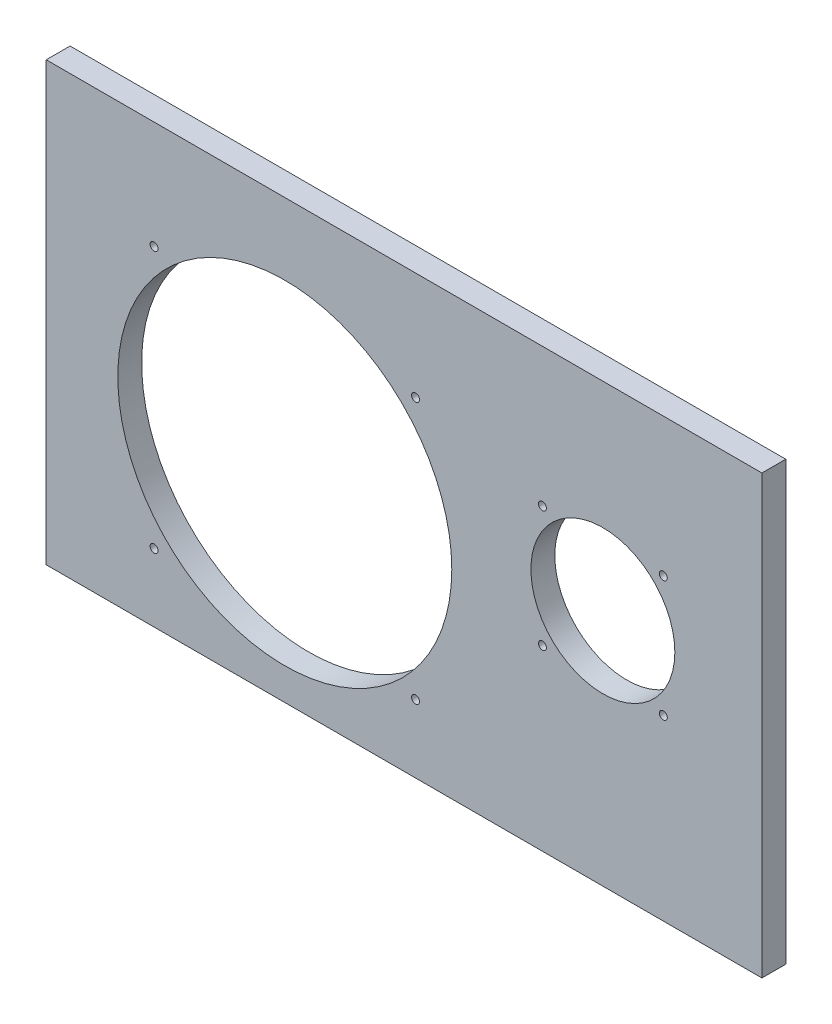
ISO-10303-21;
HEADER;
FILE_DESCRIPTION(('STEP AP214'),'2;1');
FILE_NAME('part.step','',(''),(''),'','','');
FILE_SCHEMA(('AUTOMOTIVE_DESIGN { 1 0 10303 214 1 1 1 1 }'));
ENDSEC;
DATA;
#1=APPLICATION_CONTEXT('core data for automotive mechanical design processes');
#2=APPLICATION_PROTOCOL_DEFINITION('international standard','automotive_design',2000,#1);
#3=PRODUCT_CONTEXT('',#1,'mechanical');
#4=PRODUCT('Part','Part','',(#3));
#5=PRODUCT_RELATED_PRODUCT_CATEGORY('part','',(#4));
#6=PRODUCT_DEFINITION_FORMATION('','',#4);
#7=PRODUCT_DEFINITION_CONTEXT('part definition',#1,'design');
#8=PRODUCT_DEFINITION('design','',#6,#7);
#9=PRODUCT_DEFINITION_SHAPE('','',#8);
#10=(LENGTH_UNIT() NAMED_UNIT(*) SI_UNIT(.MILLI.,.METRE.));
#11=(NAMED_UNIT(*) PLANE_ANGLE_UNIT() SI_UNIT($,.RADIAN.));
#12=(NAMED_UNIT(*) SI_UNIT($,.STERADIAN.) SOLID_ANGLE_UNIT());
#13=UNCERTAINTY_MEASURE_WITH_UNIT(LENGTH_MEASURE(1.E-05),#10,'distance_accuracy_value','');
#14=(GEOMETRIC_REPRESENTATION_CONTEXT(3) GLOBAL_UNCERTAINTY_ASSIGNED_CONTEXT((#13)) GLOBAL_UNIT_ASSIGNED_CONTEXT((#10,
#11,#12)) REPRESENTATION_CONTEXT('',''));
#15=CARTESIAN_POINT('',(0.,0.,0.));
#16=DIRECTION('',(0.,0.,1.));
#17=DIRECTION('',(1.,0.,0.));
#18=AXIS2_PLACEMENT_3D('',#15,#16,#17);
#19=CARTESIAN_POINT('',(0.,0.,6.));
#20=DIRECTION('',(0.,0.,-1.));
#21=DIRECTION('',(-1.,0.,0.));
#22=AXIS2_PLACEMENT_3D('',#19,#20,#21);
#23=PLANE('',#22);
#24=CARTESIAN_POINT('',(155.202795795511,44.7972042044892,6.));
#25=DIRECTION('',(0.,0.,-1.));
#26=DIRECTION('',(-1.,0.,0.));
#27=AXIS2_PLACEMENT_3D('',#24,#25,#26);
#28=CIRCLE('',#27,0.999999999999998);
#29=CARTESIAN_POINT('',(154.202795795511,44.7972042044892,6.));
#30=VERTEX_POINT('',#29);
#31=EDGE_CURVE('E165',#30,#30,#28,.F.);
#32=ORIENTED_EDGE('',*,*,#31,.F.);
#33=EDGE_LOOP('',(#32));
#34=FACE_BOUND('',#33,.T.);
#35=CARTESIAN_POINT('',(155.202795795511,75.2027957955108,6.));
#36=DIRECTION('',(0.,0.,-1.));
#37=DIRECTION('',(-1.,0.,0.));
#38=AXIS2_PLACEMENT_3D('',#35,#36,#37);
#39=CIRCLE('',#38,0.999999999999998);
#40=CARTESIAN_POINT('',(154.202795795511,75.2027957955108,6.));
#41=VERTEX_POINT('',#40);
#42=EDGE_CURVE('E159',#41,#41,#39,.F.);
#43=ORIENTED_EDGE('',*,*,#42,.F.);
#44=EDGE_LOOP('',(#43));
#45=FACE_BOUND('',#44,.T.);
#46=CARTESIAN_POINT('',(124.797204204489,75.2027957955107,6.));
#47=DIRECTION('',(0.,0.,-1.));
#48=DIRECTION('',(-1.,0.,0.));
#49=AXIS2_PLACEMENT_3D('',#46,#47,#48);
#50=CIRCLE('',#49,0.999999999999985);
#51=CARTESIAN_POINT('',(123.797204204489,75.2027957955107,6.));
#52=VERTEX_POINT('',#51);
#53=EDGE_CURVE('E153',#52,#52,#50,.F.);
#54=ORIENTED_EDGE('',*,*,#53,.F.);
#55=EDGE_LOOP('',(#54));
#56=FACE_BOUND('',#55,.T.);
#57=CARTESIAN_POINT('',(124.797204204489,44.7972042044892,6.));
#58=DIRECTION('',(0.,0.,-1.));
#59=DIRECTION('',(-1.,0.,0.));
#60=AXIS2_PLACEMENT_3D('',#57,#58,#59);
#61=CIRCLE('',#60,0.999999999999983);
#62=CARTESIAN_POINT('',(123.797204204489,44.7972042044892,6.));
#63=VERTEX_POINT('',#62);
#64=EDGE_CURVE('E147',#63,#63,#61,.F.);
#65=ORIENTED_EDGE('',*,*,#64,.F.);
#66=EDGE_LOOP('',(#65));
#67=FACE_BOUND('',#66,.T.);
#68=CARTESIAN_POINT('',(92.8804653251745,17.1195346748255,6.));
#69=DIRECTION('',(0.,0.,-1.));
#70=DIRECTION('',(-1.,0.,0.));
#71=AXIS2_PLACEMENT_3D('',#68,#69,#70);
#72=CIRCLE('',#71,0.999999999999998);
#73=CARTESIAN_POINT('',(91.8804653251745,17.1195346748255,6.));
#74=VERTEX_POINT('',#73);
#75=EDGE_CURVE('E141',#74,#74,#72,.F.);
#76=ORIENTED_EDGE('',*,*,#75,.F.);
#77=EDGE_LOOP('',(#76));
#78=FACE_BOUND('',#77,.T.);
#79=CARTESIAN_POINT('',(27.1195346748255,17.1195346748255,6.));
#80=DIRECTION('',(0.,0.,-1.));
#81=DIRECTION('',(-1.,0.,0.));
#82=AXIS2_PLACEMENT_3D('',#79,#80,#81);
#83=CIRCLE('',#82,1.);
#84=CARTESIAN_POINT('',(26.1195346748255,17.1195346748255,6.));
#85=VERTEX_POINT('',#84);
#86=EDGE_CURVE('E135',#85,#85,#83,.F.);
#87=ORIENTED_EDGE('',*,*,#86,.F.);
#88=EDGE_LOOP('',(#87));
#89=FACE_BOUND('',#88,.T.);
#90=CARTESIAN_POINT('',(92.8804653251745,82.8804653251745,6.));
#91=DIRECTION('',(0.,0.,-1.));
#92=DIRECTION('',(-1.,0.,0.));
#93=AXIS2_PLACEMENT_3D('',#90,#91,#92);
#94=CIRCLE('',#93,0.999999999999998);
#95=CARTESIAN_POINT('',(91.8804653251745,82.8804653251745,6.));
#96=VERTEX_POINT('',#95);
#97=EDGE_CURVE('E129',#96,#96,#94,.F.);
#98=ORIENTED_EDGE('',*,*,#97,.F.);
#99=EDGE_LOOP('',(#98));
#100=FACE_BOUND('',#99,.T.);
#101=CARTESIAN_POINT('',(27.1195346748255,82.8804653251745,6.));
#102=DIRECTION('',(0.,0.,-1.));
#103=DIRECTION('',(-1.,0.,0.));
#104=AXIS2_PLACEMENT_3D('',#101,#102,#103);
#105=CIRCLE('',#104,1.00000000000002);
#106=CARTESIAN_POINT('',(26.1195346748255,82.8804653251745,6.));
#107=VERTEX_POINT('',#106);
#108=EDGE_CURVE('E121',#107,#107,#105,.F.);
#109=ORIENTED_EDGE('',*,*,#108,.F.);
#110=EDGE_LOOP('',(#109));
#111=FACE_BOUND('',#110,.T.);
#112=DIRECTION('',(0.,-1.,0.));
#113=VECTOR('',#112,1.);
#114=CARTESIAN_POINT('',(0.,0.,6.));
#115=LINE('',#114,#113);
#116=CARTESIAN_POINT('',(0.,110.,6.));
#117=VERTEX_POINT('',#116);
#118=CARTESIAN_POINT('',(0.,0.,6.));
#119=VERTEX_POINT('',#118);
#120=EDGE_CURVE('E85',#117,#119,#115,.T.);
#121=ORIENTED_EDGE('',*,*,#120,.T.);
#122=DIRECTION('',(1.,0.,0.));
#123=VECTOR('',#122,1.);
#124=CARTESIAN_POINT('',(0.,0.,6.));
#125=LINE('',#124,#123);
#126=CARTESIAN_POINT('',(180.,0.,6.));
#127=VERTEX_POINT('',#126);
#128=EDGE_CURVE('E80',#119,#127,#125,.T.);
#129=ORIENTED_EDGE('',*,*,#128,.T.);
#130=DIRECTION('',(0.,1.,0.));
#131=VECTOR('',#130,1.);
#132=CARTESIAN_POINT('',(180.,0.,6.));
#133=LINE('',#132,#131);
#134=CARTESIAN_POINT('',(180.,110.,6.));
#135=VERTEX_POINT('',#134);
#136=EDGE_CURVE('E83',#127,#135,#133,.T.);
#137=ORIENTED_EDGE('',*,*,#136,.T.);
#138=DIRECTION('',(-1.,0.,0.));
#139=VECTOR('',#138,1.);
#140=CARTESIAN_POINT('',(0.,110.,6.));
#141=LINE('',#140,#139);
#142=EDGE_CURVE('E50',#135,#117,#141,.T.);
#143=ORIENTED_EDGE('',*,*,#142,.T.);
#144=EDGE_LOOP('',(#121,#129,#137,#143));
#145=FACE_BOUND('',#144,.T.);
#146=CARTESIAN_POINT('',(60.,50.,6.));
#147=DIRECTION('',(0.,0.,1.));
#148=DIRECTION('',(1.,0.,0.));
#149=AXIS2_PLACEMENT_3D('',#146,#147,#148);
#150=CIRCLE('',#149,42.);
#151=CARTESIAN_POINT('',(102.,50.,6.));
#152=VERTEX_POINT('',#151);
#153=EDGE_CURVE('E100',#152,#152,#150,.T.);
#154=ORIENTED_EDGE('',*,*,#153,.F.);
#155=EDGE_LOOP('',(#154));
#156=FACE_BOUND('',#155,.T.);
#157=CARTESIAN_POINT('',(140.,60.,6.));
#158=DIRECTION('',(0.,0.,1.));
#159=DIRECTION('',(1.,0.,0.));
#160=AXIS2_PLACEMENT_3D('',#157,#158,#159);
#161=CIRCLE('',#160,18.1);
#162=CARTESIAN_POINT('',(158.1,60.,6.));
#163=VERTEX_POINT('',#162);
#164=EDGE_CURVE('E115',#163,#163,#161,.T.);
#165=ORIENTED_EDGE('',*,*,#164,.F.);
#166=EDGE_LOOP('',(#165));
#167=FACE_BOUND('',#166,.T.);
#168=ADVANCED_FACE('F33',(#34,#45,#56,#67,#78,#89,#100,#111,#145,#156,#167),#23,.F.);
#169=CARTESIAN_POINT('',(0.,0.,0.));
#170=DIRECTION('',(0.,0.,-1.));
#171=DIRECTION('',(-1.,0.,0.));
#172=AXIS2_PLACEMENT_3D('',#169,#170,#171);
#173=PLANE('',#172);
#174=CARTESIAN_POINT('',(155.202795795511,44.7972042044892,0.));
#175=DIRECTION('',(0.,0.,1.));
#176=DIRECTION('',(1.,0.,0.));
#177=AXIS2_PLACEMENT_3D('',#174,#175,#176);
#178=CIRCLE('',#177,0.999999999999998);
#179=CARTESIAN_POINT('',(156.202795795511,44.7972042044892,0.));
#180=VERTEX_POINT('',#179);
#181=EDGE_CURVE('E168',#180,#180,#178,.T.);
#182=ORIENTED_EDGE('',*,*,#181,.T.);
#183=EDGE_LOOP('',(#182));
#184=FACE_BOUND('',#183,.T.);
#185=CARTESIAN_POINT('',(155.202795795511,75.2027957955108,0.));
#186=DIRECTION('',(0.,0.,1.));
#187=DIRECTION('',(1.,0.,0.));
#188=AXIS2_PLACEMENT_3D('',#185,#186,#187);
#189=CIRCLE('',#188,0.999999999999998);
#190=CARTESIAN_POINT('',(156.202795795511,75.2027957955108,0.));
#191=VERTEX_POINT('',#190);
#192=EDGE_CURVE('E162',#191,#191,#189,.T.);
#193=ORIENTED_EDGE('',*,*,#192,.T.);
#194=EDGE_LOOP('',(#193));
#195=FACE_BOUND('',#194,.T.);
#196=CARTESIAN_POINT('',(124.797204204489,75.2027957955107,0.));
#197=DIRECTION('',(0.,0.,1.));
#198=DIRECTION('',(1.,0.,0.));
#199=AXIS2_PLACEMENT_3D('',#196,#197,#198);
#200=CIRCLE('',#199,0.999999999999985);
#201=CARTESIAN_POINT('',(125.797204204489,75.2027957955107,0.));
#202=VERTEX_POINT('',#201);
#203=EDGE_CURVE('E156',#202,#202,#200,.T.);
#204=ORIENTED_EDGE('',*,*,#203,.T.);
#205=EDGE_LOOP('',(#204));
#206=FACE_BOUND('',#205,.T.);
#207=CARTESIAN_POINT('',(124.797204204489,44.7972042044892,0.));
#208=DIRECTION('',(0.,0.,1.));
#209=DIRECTION('',(1.,0.,0.));
#210=AXIS2_PLACEMENT_3D('',#207,#208,#209);
#211=CIRCLE('',#210,0.999999999999983);
#212=CARTESIAN_POINT('',(125.797204204489,44.7972042044892,0.));
#213=VERTEX_POINT('',#212);
#214=EDGE_CURVE('E150',#213,#213,#211,.T.);
#215=ORIENTED_EDGE('',*,*,#214,.T.);
#216=EDGE_LOOP('',(#215));
#217=FACE_BOUND('',#216,.T.);
#218=CARTESIAN_POINT('',(92.8804653251745,17.1195346748255,0.));
#219=DIRECTION('',(0.,0.,1.));
#220=DIRECTION('',(1.,0.,0.));
#221=AXIS2_PLACEMENT_3D('',#218,#219,#220);
#222=CIRCLE('',#221,0.999999999999998);
#223=CARTESIAN_POINT('',(93.8804653251745,17.1195346748255,0.));
#224=VERTEX_POINT('',#223);
#225=EDGE_CURVE('E144',#224,#224,#222,.T.);
#226=ORIENTED_EDGE('',*,*,#225,.T.);
#227=EDGE_LOOP('',(#226));
#228=FACE_BOUND('',#227,.T.);
#229=CARTESIAN_POINT('',(27.1195346748255,17.1195346748255,0.));
#230=DIRECTION('',(0.,0.,1.));
#231=DIRECTION('',(1.,0.,0.));
#232=AXIS2_PLACEMENT_3D('',#229,#230,#231);
#233=CIRCLE('',#232,1.);
#234=CARTESIAN_POINT('',(28.1195346748255,17.1195346748255,0.));
#235=VERTEX_POINT('',#234);
#236=EDGE_CURVE('E138',#235,#235,#233,.T.);
#237=ORIENTED_EDGE('',*,*,#236,.T.);
#238=EDGE_LOOP('',(#237));
#239=FACE_BOUND('',#238,.T.);
#240=CARTESIAN_POINT('',(92.8804653251745,82.8804653251745,0.));
#241=DIRECTION('',(0.,0.,1.));
#242=DIRECTION('',(1.,0.,0.));
#243=AXIS2_PLACEMENT_3D('',#240,#241,#242);
#244=CIRCLE('',#243,0.999999999999998);
#245=CARTESIAN_POINT('',(93.8804653251745,82.8804653251745,0.));
#246=VERTEX_POINT('',#245);
#247=EDGE_CURVE('E132',#246,#246,#244,.T.);
#248=ORIENTED_EDGE('',*,*,#247,.T.);
#249=EDGE_LOOP('',(#248));
#250=FACE_BOUND('',#249,.T.);
#251=CARTESIAN_POINT('',(27.1195346748255,82.8804653251745,0.));
#252=DIRECTION('',(0.,0.,1.));
#253=DIRECTION('',(1.,0.,0.));
#254=AXIS2_PLACEMENT_3D('',#251,#252,#253);
#255=CIRCLE('',#254,1.00000000000002);
#256=CARTESIAN_POINT('',(28.1195346748255,82.8804653251745,0.));
#257=VERTEX_POINT('',#256);
#258=EDGE_CURVE('E126',#257,#257,#255,.T.);
#259=ORIENTED_EDGE('',*,*,#258,.T.);
#260=EDGE_LOOP('',(#259));
#261=FACE_BOUND('',#260,.T.);
#262=CARTESIAN_POINT('',(60.,50.,0.));
#263=DIRECTION('',(0.,0.,1.));
#264=DIRECTION('',(1.,0.,0.));
#265=AXIS2_PLACEMENT_3D('',#262,#263,#264);
#266=CIRCLE('',#265,42.);
#267=CARTESIAN_POINT('',(102.,50.,0.));
#268=VERTEX_POINT('',#267);
#269=EDGE_CURVE('E112',#268,#268,#266,.T.);
#270=ORIENTED_EDGE('',*,*,#269,.T.);
#271=EDGE_LOOP('',(#270));
#272=FACE_BOUND('',#271,.T.);
#273=DIRECTION('',(0.,-1.,0.));
#274=VECTOR('',#273,1.);
#275=CARTESIAN_POINT('',(0.,0.,0.));
#276=LINE('',#275,#274);
#277=CARTESIAN_POINT('',(0.,110.,0.));
#278=VERTEX_POINT('',#277);
#279=CARTESIAN_POINT('',(0.,0.,0.));
#280=VERTEX_POINT('',#279);
#281=EDGE_CURVE('E97',#278,#280,#276,.T.);
#282=ORIENTED_EDGE('',*,*,#281,.F.);
#283=DIRECTION('',(-1.,0.,0.));
#284=VECTOR('',#283,1.);
#285=CARTESIAN_POINT('',(0.,110.,0.));
#286=LINE('',#285,#284);
#287=CARTESIAN_POINT('',(180.,110.,0.));
#288=VERTEX_POINT('',#287);
#289=EDGE_CURVE('E73',#288,#278,#286,.T.);
#290=ORIENTED_EDGE('',*,*,#289,.F.);
#291=DIRECTION('',(0.,1.,0.));
#292=VECTOR('',#291,1.);
#293=CARTESIAN_POINT('',(180.,0.,0.));
#294=LINE('',#293,#292);
#295=CARTESIAN_POINT('',(180.,0.,0.));
#296=VERTEX_POINT('',#295);
#297=EDGE_CURVE('E67',#296,#288,#294,.T.);
#298=ORIENTED_EDGE('',*,*,#297,.F.);
#299=DIRECTION('',(1.,0.,0.));
#300=VECTOR('',#299,1.);
#301=CARTESIAN_POINT('',(0.,0.,0.));
#302=LINE('',#301,#300);
#303=EDGE_CURVE('E89',#280,#296,#302,.T.);
#304=ORIENTED_EDGE('',*,*,#303,.F.);
#305=EDGE_LOOP('',(#282,#290,#298,#304));
#306=FACE_BOUND('',#305,.T.);
#307=CARTESIAN_POINT('',(140.,60.,0.));
#308=DIRECTION('',(0.,0.,1.));
#309=DIRECTION('',(1.,0.,0.));
#310=AXIS2_PLACEMENT_3D('',#307,#308,#309);
#311=CIRCLE('',#310,18.1);
#312=CARTESIAN_POINT('',(158.1,60.,0.));
#313=VERTEX_POINT('',#312);
#314=EDGE_CURVE('E118',#313,#313,#311,.T.);
#315=ORIENTED_EDGE('',*,*,#314,.T.);
#316=EDGE_LOOP('',(#315));
#317=FACE_BOUND('',#316,.T.);
#318=ADVANCED_FACE('F108',(#184,#195,#206,#217,#228,#239,#250,#261,#272,#306,#317),#173,.T.);
#319=CARTESIAN_POINT('',(0.,0.,6.));
#320=DIRECTION('',(1.,0.,0.));
#321=DIRECTION('',(0.,0.,-1.));
#322=AXIS2_PLACEMENT_3D('',#319,#320,#321);
#323=PLANE('',#322);
#324=ORIENTED_EDGE('',*,*,#281,.T.);
#325=DIRECTION('',(0.,0.,-1.));
#326=VECTOR('',#325,1.);
#327=CARTESIAN_POINT('',(0.,0.,6.));
#328=LINE('',#327,#326);
#329=EDGE_CURVE('E11',#119,#280,#328,.T.);
#330=ORIENTED_EDGE('',*,*,#329,.F.);
#331=ORIENTED_EDGE('',*,*,#120,.F.);
#332=DIRECTION('',(0.,0.,-1.));
#333=VECTOR('',#332,1.);
#334=CARTESIAN_POINT('',(0.,110.,6.));
#335=LINE('',#334,#333);
#336=EDGE_CURVE('E93',#117,#278,#335,.T.);
#337=ORIENTED_EDGE('',*,*,#336,.T.);
#338=EDGE_LOOP('',(#324,#330,#331,#337));
#339=FACE_BOUND('',#338,.T.);
#340=ADVANCED_FACE('F35',(#339),#323,.F.);
#341=CARTESIAN_POINT('',(0.,0.,6.));
#342=DIRECTION('',(0.,1.,0.));
#343=DIRECTION('',(0.,0.,1.));
#344=AXIS2_PLACEMENT_3D('',#341,#342,#343);
#345=PLANE('',#344);
#346=ORIENTED_EDGE('',*,*,#303,.T.);
#347=DIRECTION('',(0.,0.,-1.));
#348=VECTOR('',#347,1.);
#349=CARTESIAN_POINT('',(180.,0.,6.));
#350=LINE('',#349,#348);
#351=EDGE_CURVE('E42',#127,#296,#350,.T.);
#352=ORIENTED_EDGE('',*,*,#351,.F.);
#353=ORIENTED_EDGE('',*,*,#128,.F.);
#354=ORIENTED_EDGE('',*,*,#329,.T.);
#355=EDGE_LOOP('',(#346,#352,#353,#354));
#356=FACE_BOUND('',#355,.T.);
#357=ADVANCED_FACE('F88',(#356),#345,.F.);
#358=CARTESIAN_POINT('',(180.,0.,6.));
#359=DIRECTION('',(-1.,0.,0.));
#360=DIRECTION('',(0.,0.,1.));
#361=AXIS2_PLACEMENT_3D('',#358,#359,#360);
#362=PLANE('',#361);
#363=ORIENTED_EDGE('',*,*,#297,.T.);
#364=DIRECTION('',(0.,0.,-1.));
#365=VECTOR('',#364,1.);
#366=CARTESIAN_POINT('',(180.,110.,6.));
#367=LINE('',#366,#365);
#368=EDGE_CURVE('E90',#135,#288,#367,.T.);
#369=ORIENTED_EDGE('',*,*,#368,.F.);
#370=ORIENTED_EDGE('',*,*,#136,.F.);
#371=ORIENTED_EDGE('',*,*,#351,.T.);
#372=EDGE_LOOP('',(#363,#369,#370,#371));
#373=FACE_BOUND('',#372,.T.);
#374=ADVANCED_FACE('F91',(#373),#362,.F.);
#375=CARTESIAN_POINT('',(0.,110.,6.));
#376=DIRECTION('',(0.,-1.,0.));
#377=DIRECTION('',(0.,0.,-1.));
#378=AXIS2_PLACEMENT_3D('',#375,#376,#377);
#379=PLANE('',#378);
#380=ORIENTED_EDGE('',*,*,#289,.T.);
#381=ORIENTED_EDGE('',*,*,#336,.F.);
#382=ORIENTED_EDGE('',*,*,#142,.F.);
#383=ORIENTED_EDGE('',*,*,#368,.T.);
#384=EDGE_LOOP('',(#380,#381,#382,#383));
#385=FACE_BOUND('',#384,.T.);
#386=ADVANCED_FACE('F105',(#385),#379,.F.);
#387=CARTESIAN_POINT('',(60.,50.,6.));
#388=DIRECTION('',(0.,0.,-1.));
#389=DIRECTION('',(-1.,0.,0.));
#390=AXIS2_PLACEMENT_3D('',#387,#388,#389);
#391=CYLINDRICAL_SURFACE('',#390,42.);
#392=ORIENTED_EDGE('',*,*,#153,.T.);
#393=EDGE_LOOP('',(#392));
#394=FACE_BOUND('',#393,.T.);
#395=ORIENTED_EDGE('',*,*,#269,.F.);
#396=EDGE_LOOP('',(#395));
#397=FACE_BOUND('',#396,.T.);
#398=ADVANCED_FACE('F211',(#394,#397),#391,.F.);
#399=CARTESIAN_POINT('',(140.,60.,6.));
#400=DIRECTION('',(0.,0.,-1.));
#401=DIRECTION('',(-1.,0.,0.));
#402=AXIS2_PLACEMENT_3D('',#399,#400,#401);
#403=CYLINDRICAL_SURFACE('',#402,18.1);
#404=ORIENTED_EDGE('',*,*,#164,.T.);
#405=EDGE_LOOP('',(#404));
#406=FACE_BOUND('',#405,.T.);
#407=ORIENTED_EDGE('',*,*,#314,.F.);
#408=EDGE_LOOP('',(#407));
#409=FACE_BOUND('',#408,.T.);
#410=ADVANCED_FACE('F201',(#406,#409),#403,.F.);
#411=CARTESIAN_POINT('',(27.1195346748255,82.8804653251745,30.));
#412=DIRECTION('',(0.,0.,-1.));
#413=DIRECTION('',(-1.,0.,0.));
#414=AXIS2_PLACEMENT_3D('',#411,#412,#413);
#415=CYLINDRICAL_SURFACE('',#414,1.00000000000002);
#416=ORIENTED_EDGE('',*,*,#258,.F.);
#417=EDGE_LOOP('',(#416));
#418=FACE_BOUND('',#417,.T.);
#419=ORIENTED_EDGE('',*,*,#108,.T.);
#420=EDGE_LOOP('',(#419));
#421=FACE_BOUND('',#420,.T.);
#422=ADVANCED_FACE('F198',(#418,#421),#415,.F.);
#423=CARTESIAN_POINT('',(92.8804653251745,82.8804653251745,30.));
#424=DIRECTION('',(0.,0.,-1.));
#425=DIRECTION('',(-1.,0.,0.));
#426=AXIS2_PLACEMENT_3D('',#423,#424,#425);
#427=CYLINDRICAL_SURFACE('',#426,0.999999999999998);
#428=ORIENTED_EDGE('',*,*,#247,.F.);
#429=EDGE_LOOP('',(#428));
#430=FACE_BOUND('',#429,.T.);
#431=ORIENTED_EDGE('',*,*,#97,.T.);
#432=EDGE_LOOP('',(#431));
#433=FACE_BOUND('',#432,.T.);
#434=ADVANCED_FACE('F200',(#430,#433),#427,.F.);
#435=CARTESIAN_POINT('',(27.1195346748255,17.1195346748255,30.));
#436=DIRECTION('',(0.,0.,-1.));
#437=DIRECTION('',(-1.,0.,0.));
#438=AXIS2_PLACEMENT_3D('',#435,#436,#437);
#439=CYLINDRICAL_SURFACE('',#438,1.);
#440=ORIENTED_EDGE('',*,*,#236,.F.);
#441=EDGE_LOOP('',(#440));
#442=FACE_BOUND('',#441,.T.);
#443=ORIENTED_EDGE('',*,*,#86,.T.);
#444=EDGE_LOOP('',(#443));
#445=FACE_BOUND('',#444,.T.);
#446=ADVANCED_FACE('F208',(#442,#445),#439,.F.);
#447=CARTESIAN_POINT('',(92.8804653251745,17.1195346748255,30.));
#448=DIRECTION('',(0.,0.,-1.));
#449=DIRECTION('',(-1.,0.,0.));
#450=AXIS2_PLACEMENT_3D('',#447,#448,#449);
#451=CYLINDRICAL_SURFACE('',#450,0.999999999999998);
#452=ORIENTED_EDGE('',*,*,#225,.F.);
#453=EDGE_LOOP('',(#452));
#454=FACE_BOUND('',#453,.T.);
#455=ORIENTED_EDGE('',*,*,#75,.T.);
#456=EDGE_LOOP('',(#455));
#457=FACE_BOUND('',#456,.T.);
#458=ADVANCED_FACE('F290',(#454,#457),#451,.F.);
#459=CARTESIAN_POINT('',(124.797204204489,44.7972042044892,30.));
#460=DIRECTION('',(0.,0.,-1.));
#461=DIRECTION('',(-1.,0.,0.));
#462=AXIS2_PLACEMENT_3D('',#459,#460,#461);
#463=CYLINDRICAL_SURFACE('',#462,0.999999999999983);
#464=ORIENTED_EDGE('',*,*,#214,.F.);
#465=EDGE_LOOP('',(#464));
#466=FACE_BOUND('',#465,.T.);
#467=ORIENTED_EDGE('',*,*,#64,.T.);
#468=EDGE_LOOP('',(#467));
#469=FACE_BOUND('',#468,.T.);
#470=ADVANCED_FACE('F298',(#466,#469),#463,.F.);
#471=CARTESIAN_POINT('',(124.797204204489,75.2027957955107,30.));
#472=DIRECTION('',(0.,0.,-1.));
#473=DIRECTION('',(-1.,0.,0.));
#474=AXIS2_PLACEMENT_3D('',#471,#472,#473);
#475=CYLINDRICAL_SURFACE('',#474,0.999999999999985);
#476=ORIENTED_EDGE('',*,*,#203,.F.);
#477=EDGE_LOOP('',(#476));
#478=FACE_BOUND('',#477,.T.);
#479=ORIENTED_EDGE('',*,*,#53,.T.);
#480=EDGE_LOOP('',(#479));
#481=FACE_BOUND('',#480,.T.);
#482=ADVANCED_FACE('F307',(#478,#481),#475,.F.);
#483=CARTESIAN_POINT('',(155.202795795511,75.2027957955108,30.));
#484=DIRECTION('',(0.,0.,-1.));
#485=DIRECTION('',(-1.,0.,0.));
#486=AXIS2_PLACEMENT_3D('',#483,#484,#485);
#487=CYLINDRICAL_SURFACE('',#486,0.999999999999998);
#488=ORIENTED_EDGE('',*,*,#192,.F.);
#489=EDGE_LOOP('',(#488));
#490=FACE_BOUND('',#489,.T.);
#491=ORIENTED_EDGE('',*,*,#42,.T.);
#492=EDGE_LOOP('',(#491));
#493=FACE_BOUND('',#492,.T.);
#494=ADVANCED_FACE('F177',(#490,#493),#487,.F.);
#495=CARTESIAN_POINT('',(155.202795795511,44.7972042044892,30.));
#496=DIRECTION('',(0.,0.,-1.));
#497=DIRECTION('',(-1.,0.,0.));
#498=AXIS2_PLACEMENT_3D('',#495,#496,#497);
#499=CYLINDRICAL_SURFACE('',#498,0.999999999999998);
#500=ORIENTED_EDGE('',*,*,#181,.F.);
#501=EDGE_LOOP('',(#500));
#502=FACE_BOUND('',#501,.T.);
#503=ORIENTED_EDGE('',*,*,#31,.T.);
#504=EDGE_LOOP('',(#503));
#505=FACE_BOUND('',#504,.T.);
#506=ADVANCED_FACE('F174',(#502,#505),#499,.F.);
#507=CLOSED_SHELL('',(#168,#318,#340,#357,#374,#386,#398,#410,#422,#434,#446,#458,#470,#482,
#494,#506));
#508=MANIFOLD_SOLID_BREP('B2',#507);
#509=ADVANCED_BREP_SHAPE_REPRESENTATION('',(#18,#508),#14);
#510=SHAPE_DEFINITION_REPRESENTATION(#9,#509);
ENDSEC;
END-ISO-10303-21;
